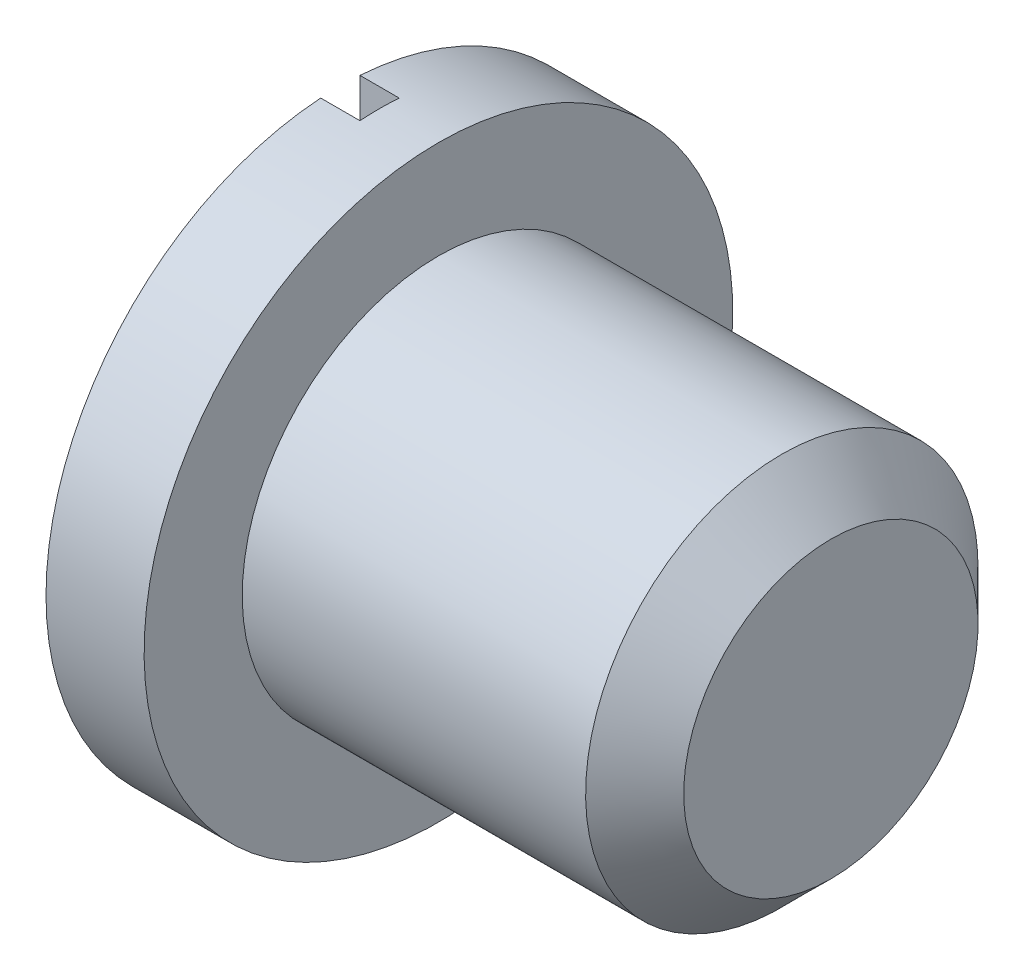
ISO-10303-21;
HEADER;
FILE_DESCRIPTION(('STEP AP214'),'2;1');
FILE_NAME('part.step','',(''),(''),'','','');
FILE_SCHEMA(('AUTOMOTIVE_DESIGN { 1 0 10303 214 1 1 1 1 }'));
ENDSEC;
DATA;
#1=APPLICATION_CONTEXT('core data for automotive mechanical design processes');
#2=APPLICATION_PROTOCOL_DEFINITION('international standard','automotive_design',2000,#1);
#3=PRODUCT_CONTEXT('',#1,'mechanical');
#4=PRODUCT('Part','Part','',(#3));
#5=PRODUCT_RELATED_PRODUCT_CATEGORY('part','',(#4));
#6=PRODUCT_DEFINITION_FORMATION('','',#4);
#7=PRODUCT_DEFINITION_CONTEXT('part definition',#1,'design');
#8=PRODUCT_DEFINITION('design','',#6,#7);
#9=PRODUCT_DEFINITION_SHAPE('','',#8);
#10=(LENGTH_UNIT() NAMED_UNIT(*) SI_UNIT(.MILLI.,.METRE.));
#11=(NAMED_UNIT(*) PLANE_ANGLE_UNIT() SI_UNIT($,.RADIAN.));
#12=(NAMED_UNIT(*) SI_UNIT($,.STERADIAN.) SOLID_ANGLE_UNIT());
#13=UNCERTAINTY_MEASURE_WITH_UNIT(LENGTH_MEASURE(1.E-05),#10,'distance_accuracy_value','');
#14=(GEOMETRIC_REPRESENTATION_CONTEXT(3) GLOBAL_UNCERTAINTY_ASSIGNED_CONTEXT((#13)) GLOBAL_UNIT_ASSIGNED_CONTEXT((#10,
#11,#12)) REPRESENTATION_CONTEXT('',''));
#15=CARTESIAN_POINT('',(0.,0.,0.));
#16=DIRECTION('',(0.,0.,1.));
#17=DIRECTION('',(1.,0.,0.));
#18=AXIS2_PLACEMENT_3D('',#15,#16,#17);
#19=CARTESIAN_POINT('',(0.,0.,0.));
#20=DIRECTION('',(-1.,0.,0.));
#21=DIRECTION('',(0.,-1.,0.));
#22=AXIS2_PLACEMENT_3D('',#19,#20,#21);
#23=PLANE('',#22);
#24=DIRECTION('',(0.,1.,0.));
#25=VECTOR('',#24,1.);
#26=CARTESIAN_POINT('',(0.,0.748331477354788,0.0499999999999996));
#27=LINE('',#26,#25);
#28=CARTESIAN_POINT('',(0.,-0.748331477354788,0.05));
#29=VERTEX_POINT('',#28);
#30=CARTESIAN_POINT('',(0.,0.748331477354788,0.0499999999999996));
#31=VERTEX_POINT('',#30);
#32=EDGE_CURVE('E76',#29,#31,#27,.T.);
#33=ORIENTED_EDGE('',*,*,#32,.F.);
#34=CARTESIAN_POINT('',(0.,0.,0.));
#35=DIRECTION('',(1.,0.,0.));
#36=DIRECTION('',(0.,1.,0.));
#37=AXIS2_PLACEMENT_3D('',#34,#35,#36);
#38=CIRCLE('',#37,0.75);
#39=EDGE_CURVE('E110',#31,#29,#38,.T.);
#40=ORIENTED_EDGE('',*,*,#39,.F.);
#41=EDGE_LOOP('',(#33,#40));
#42=FACE_BOUND('',#41,.T.);
#43=ADVANCED_FACE('F36',(#42),#23,.T.);
#44=DIRECTION('',(0.,-1.,0.));
#45=VECTOR('',#44,1.);
#46=CARTESIAN_POINT('',(0.,0.748331477354788,-0.0500000000000002));
#47=LINE('',#46,#45);
#48=CARTESIAN_POINT('',(0.,0.748331477354788,-0.0500000000000002));
#49=VERTEX_POINT('',#48);
#50=CARTESIAN_POINT('',(0.,-0.748331477354788,-0.05));
#51=VERTEX_POINT('',#50);
#52=EDGE_CURVE('E229',#49,#51,#47,.T.);
#53=ORIENTED_EDGE('',*,*,#52,.F.);
#54=EDGE_CURVE('E97',#51,#49,#38,.T.);
#55=ORIENTED_EDGE('',*,*,#54,.F.);
#56=EDGE_LOOP('',(#53,#55));
#57=FACE_BOUND('',#56,.T.);
#58=ADVANCED_FACE('F129',(#57),#23,.T.);
#59=CARTESIAN_POINT('',(1.25,0.,0.));
#60=DIRECTION('',(1.,0.,0.));
#61=DIRECTION('',(0.,1.,0.));
#62=AXIS2_PLACEMENT_3D('',#59,#60,#61);
#63=CYLINDRICAL_SURFACE('',#62,0.75);
#64=DIRECTION('',(-1.,0.,0.));
#65=VECTOR('',#64,1.);
#66=CARTESIAN_POINT('',(0.1,0.748331477354788,0.0499999999999996));
#67=LINE('',#66,#65);
#68=CARTESIAN_POINT('',(0.1,0.748331477354788,0.0499999999999996));
#69=VERTEX_POINT('',#68);
#70=EDGE_CURVE('E60',#69,#31,#67,.T.);
#71=ORIENTED_EDGE('',*,*,#70,.T.);
#72=ORIENTED_EDGE('',*,*,#39,.T.);
#73=DIRECTION('',(-1.,0.,0.));
#74=VECTOR('',#73,1.);
#75=CARTESIAN_POINT('',(0.1,-0.748331477354788,0.05));
#76=LINE('',#75,#74);
#77=CARTESIAN_POINT('',(0.1,-0.748331477354788,0.05));
#78=VERTEX_POINT('',#77);
#79=EDGE_CURVE('E99',#78,#29,#76,.T.);
#80=ORIENTED_EDGE('',*,*,#79,.F.);
#81=CARTESIAN_POINT('',(0.1,0.,0.));
#82=DIRECTION('',(-1.,0.,0.));
#83=DIRECTION('',(0.,-1.,0.));
#84=AXIS2_PLACEMENT_3D('',#81,#82,#83);
#85=CIRCLE('',#84,0.75);
#86=CARTESIAN_POINT('',(0.1,-0.748331477354788,-0.05));
#87=VERTEX_POINT('',#86);
#88=EDGE_CURVE('E85',#87,#78,#85,.T.);
#89=ORIENTED_EDGE('',*,*,#88,.F.);
#90=DIRECTION('',(-1.,0.,0.));
#91=VECTOR('',#90,1.);
#92=CARTESIAN_POINT('',(0.1,-0.748331477354788,-0.05));
#93=LINE('',#92,#91);
#94=EDGE_CURVE('E83',#87,#51,#93,.T.);
#95=ORIENTED_EDGE('',*,*,#94,.T.);
#96=ORIENTED_EDGE('',*,*,#54,.T.);
#97=DIRECTION('',(-1.,0.,0.));
#98=VECTOR('',#97,1.);
#99=CARTESIAN_POINT('',(0.1,0.748331477354788,-0.0500000000000002));
#100=LINE('',#99,#98);
#101=CARTESIAN_POINT('',(0.1,0.748331477354788,-0.0500000000000002));
#102=VERTEX_POINT('',#101);
#103=EDGE_CURVE('E80',#102,#49,#100,.T.);
#104=ORIENTED_EDGE('',*,*,#103,.F.);
#105=CARTESIAN_POINT('',(0.1,0.,0.));
#106=DIRECTION('',(-1.,0.,0.));
#107=DIRECTION('',(0.,-1.,0.));
#108=AXIS2_PLACEMENT_3D('',#105,#106,#107);
#109=CIRCLE('',#108,0.75);
#110=EDGE_CURVE('E86',#69,#102,#109,.T.);
#111=ORIENTED_EDGE('',*,*,#110,.F.);
#112=EDGE_LOOP('',(#71,#72,#80,#89,#95,#96,#104,#111));
#113=FACE_BOUND('',#112,.T.);
#114=CARTESIAN_POINT('',(0.25,0.,0.));
#115=DIRECTION('',(1.,0.,0.));
#116=DIRECTION('',(0.,1.,0.));
#117=AXIS2_PLACEMENT_3D('',#114,#115,#116);
#118=CIRCLE('',#117,0.75);
#119=CARTESIAN_POINT('',(0.25,0.75,0.));
#120=VERTEX_POINT('',#119);
#121=EDGE_CURVE('E107',#120,#120,#118,.T.);
#122=ORIENTED_EDGE('',*,*,#121,.F.);
#123=EDGE_LOOP('',(#122));
#124=FACE_BOUND('',#123,.T.);
#125=ADVANCED_FACE('F94',(#113,#124),#63,.T.);
#126=CARTESIAN_POINT('',(0.25,0.75,0.));
#127=DIRECTION('',(1.,0.,0.));
#128=DIRECTION('',(0.,1.,0.));
#129=AXIS2_PLACEMENT_3D('',#126,#127,#128);
#130=PLANE('',#129);
#131=ORIENTED_EDGE('',*,*,#121,.T.);
#132=EDGE_LOOP('',(#131));
#133=FACE_BOUND('',#132,.T.);
#134=CARTESIAN_POINT('',(0.25,0.,0.));
#135=DIRECTION('',(1.,0.,0.));
#136=DIRECTION('',(0.,1.,0.));
#137=AXIS2_PLACEMENT_3D('',#134,#135,#136);
#138=CIRCLE('',#137,0.5);
#139=CARTESIAN_POINT('',(0.25,0.5,0.));
#140=VERTEX_POINT('',#139);
#141=EDGE_CURVE('E104',#140,#140,#138,.T.);
#142=ORIENTED_EDGE('',*,*,#141,.F.);
#143=EDGE_LOOP('',(#142));
#144=FACE_BOUND('',#143,.T.);
#145=ADVANCED_FACE('F138',(#133,#144),#130,.T.);
#146=CARTESIAN_POINT('',(1.25,0.,0.));
#147=DIRECTION('',(1.,0.,0.));
#148=DIRECTION('',(0.,1.,0.));
#149=AXIS2_PLACEMENT_3D('',#146,#147,#148);
#150=CYLINDRICAL_SURFACE('',#149,0.5);
#151=CARTESIAN_POINT('',(1.125,0.,0.));
#152=DIRECTION('',(1.,0.,0.));
#153=DIRECTION('',(0.,1.,0.));
#154=AXIS2_PLACEMENT_3D('',#151,#152,#153);
#155=CIRCLE('',#154,0.5);
#156=CARTESIAN_POINT('',(1.125,0.5,0.));
#157=VERTEX_POINT('',#156);
#158=EDGE_CURVE('E11',#157,#157,#155,.F.);
#159=ORIENTED_EDGE('',*,*,#158,.T.);
#160=EDGE_LOOP('',(#159));
#161=FACE_BOUND('',#160,.T.);
#162=ORIENTED_EDGE('',*,*,#141,.T.);
#163=EDGE_LOOP('',(#162));
#164=FACE_BOUND('',#163,.T.);
#165=ADVANCED_FACE('F125',(#161,#164),#150,.T.);
#166=CARTESIAN_POINT('',(1.25,0.5,0.));
#167=DIRECTION('',(1.,0.,0.));
#168=DIRECTION('',(0.,1.,0.));
#169=AXIS2_PLACEMENT_3D('',#166,#167,#168);
#170=PLANE('',#169);
#171=CARTESIAN_POINT('',(1.25,0.,0.));
#172=DIRECTION('',(1.,0.,0.));
#173=DIRECTION('',(0.,1.,0.));
#174=AXIS2_PLACEMENT_3D('',#171,#172,#173);
#175=CIRCLE('',#174,0.375);
#176=CARTESIAN_POINT('',(1.25,0.375,0.));
#177=VERTEX_POINT('',#176);
#178=EDGE_CURVE('E44',#177,#177,#175,.T.);
#179=ORIENTED_EDGE('',*,*,#178,.T.);
#180=EDGE_LOOP('',(#179));
#181=FACE_BOUND('',#180,.T.);
#182=ADVANCED_FACE('F115',(#181),#170,.T.);
#183=CARTESIAN_POINT('',(1.25,0.,0.));
#184=DIRECTION('',(-1.,0.,0.));
#185=DIRECTION('',(0.,-1.,0.));
#186=AXIS2_PLACEMENT_3D('',#183,#184,#185);
#187=CONICAL_SURFACE('',#186,0.375,0.785398163397446);
#188=ORIENTED_EDGE('',*,*,#158,.F.);
#189=EDGE_LOOP('',(#188));
#190=FACE_BOUND('',#189,.T.);
#191=ORIENTED_EDGE('',*,*,#178,.F.);
#192=EDGE_LOOP('',(#191));
#193=FACE_BOUND('',#192,.T.);
#194=ADVANCED_FACE('F38',(#190,#193),#187,.T.);
#195=CARTESIAN_POINT('',(0.1,0.748331477354788,0.0499999999999996));
#196=DIRECTION('',(0.,0.,1.));
#197=DIRECTION('',(0.,-1.,0.));
#198=AXIS2_PLACEMENT_3D('',#195,#196,#197);
#199=PLANE('',#198);
#200=ORIENTED_EDGE('',*,*,#32,.T.);
#201=ORIENTED_EDGE('',*,*,#70,.F.);
#202=DIRECTION('',(0.,1.,0.));
#203=VECTOR('',#202,1.);
#204=CARTESIAN_POINT('',(0.1,0.748331477354788,0.0499999999999996));
#205=LINE('',#204,#203);
#206=EDGE_CURVE('E90',#78,#69,#205,.T.);
#207=ORIENTED_EDGE('',*,*,#206,.F.);
#208=ORIENTED_EDGE('',*,*,#79,.T.);
#209=EDGE_LOOP('',(#200,#201,#207,#208));
#210=FACE_BOUND('',#209,.T.);
#211=ADVANCED_FACE('F118',(#210),#199,.F.);
#212=CARTESIAN_POINT('',(0.1,0.748331477354788,-0.0500000000000002));
#213=DIRECTION('',(0.,0.,-1.));
#214=DIRECTION('',(0.,1.,0.));
#215=AXIS2_PLACEMENT_3D('',#212,#213,#214);
#216=PLANE('',#215);
#217=ORIENTED_EDGE('',*,*,#52,.T.);
#218=ORIENTED_EDGE('',*,*,#94,.F.);
#219=DIRECTION('',(0.,-1.,0.));
#220=VECTOR('',#219,1.);
#221=CARTESIAN_POINT('',(0.1,0.748331477354788,-0.0500000000000002));
#222=LINE('',#221,#220);
#223=EDGE_CURVE('E51',#102,#87,#222,.T.);
#224=ORIENTED_EDGE('',*,*,#223,.F.);
#225=ORIENTED_EDGE('',*,*,#103,.T.);
#226=EDGE_LOOP('',(#217,#218,#224,#225));
#227=FACE_BOUND('',#226,.T.);
#228=ADVANCED_FACE('F78',(#227),#216,.F.);
#229=CARTESIAN_POINT('',(0.1,0.,0.));
#230=DIRECTION('',(-1.,0.,0.));
#231=DIRECTION('',(0.,-1.,0.));
#232=AXIS2_PLACEMENT_3D('',#229,#230,#231);
#233=PLANE('',#232);
#234=ORIENTED_EDGE('',*,*,#110,.T.);
#235=ORIENTED_EDGE('',*,*,#223,.T.);
#236=ORIENTED_EDGE('',*,*,#88,.T.);
#237=ORIENTED_EDGE('',*,*,#206,.T.);
#238=EDGE_LOOP('',(#234,#235,#236,#237));
#239=FACE_BOUND('',#238,.T.);
#240=ADVANCED_FACE('F89',(#239),#233,.T.);
#241=CLOSED_SHELL('',(#43,#58,#125,#145,#165,#182,#194,#211,#228,#240));
#242=MANIFOLD_SOLID_BREP('B2',#241);
#243=ADVANCED_BREP_SHAPE_REPRESENTATION('',(#18,#242),#14);
#244=SHAPE_DEFINITION_REPRESENTATION(#9,#243);
ENDSEC;
END-ISO-10303-21;
